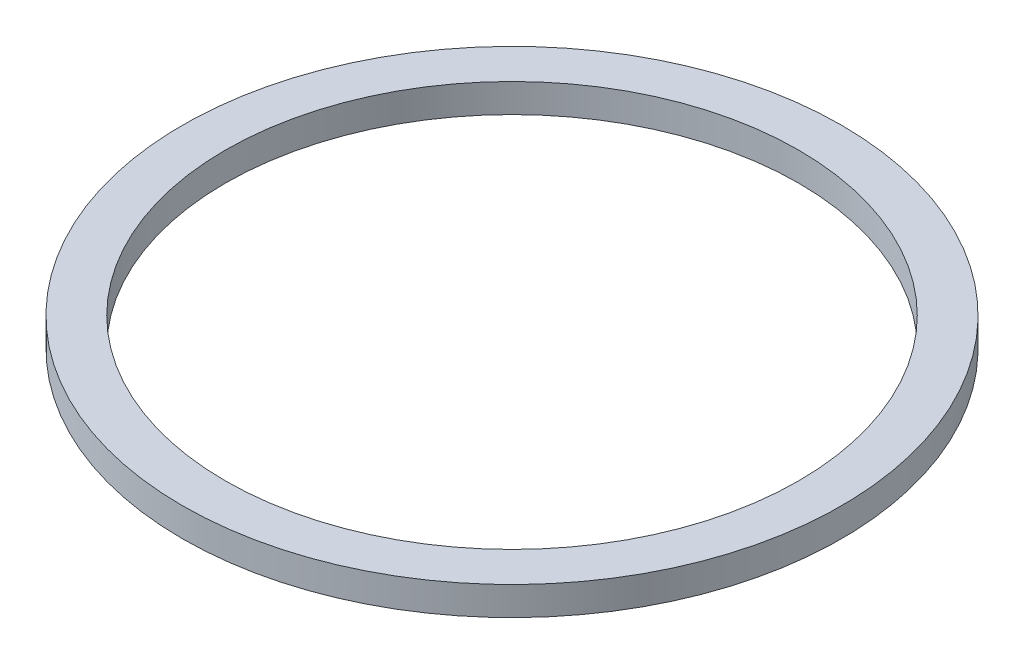
ISO-10303-21;
HEADER;
FILE_DESCRIPTION(('STEP AP214'),'2;1');
FILE_NAME('part.step','',(''),(''),'','','');
FILE_SCHEMA(('AUTOMOTIVE_DESIGN { 1 0 10303 214 1 1 1 1 }'));
ENDSEC;
DATA;
#1=APPLICATION_CONTEXT('core data for automotive mechanical design processes');
#2=APPLICATION_PROTOCOL_DEFINITION('international standard','automotive_design',2000,#1);
#3=PRODUCT_CONTEXT('',#1,'mechanical');
#4=PRODUCT('Part','Part','',(#3));
#5=PRODUCT_RELATED_PRODUCT_CATEGORY('part','',(#4));
#6=PRODUCT_DEFINITION_FORMATION('','',#4);
#7=PRODUCT_DEFINITION_CONTEXT('part definition',#1,'design');
#8=PRODUCT_DEFINITION('design','',#6,#7);
#9=PRODUCT_DEFINITION_SHAPE('','',#8);
#10=(LENGTH_UNIT() NAMED_UNIT(*) SI_UNIT(.MILLI.,.METRE.));
#11=(NAMED_UNIT(*) PLANE_ANGLE_UNIT() SI_UNIT($,.RADIAN.));
#12=(NAMED_UNIT(*) SI_UNIT($,.STERADIAN.) SOLID_ANGLE_UNIT());
#13=UNCERTAINTY_MEASURE_WITH_UNIT(LENGTH_MEASURE(1.E-05),#10,'distance_accuracy_value','');
#14=(GEOMETRIC_REPRESENTATION_CONTEXT(3) GLOBAL_UNCERTAINTY_ASSIGNED_CONTEXT((#13)) GLOBAL_UNIT_ASSIGNED_CONTEXT((#10,
#11,#12)) REPRESENTATION_CONTEXT('',''));
#15=CARTESIAN_POINT('',(0.,0.,0.));
#16=DIRECTION('',(0.,0.,1.));
#17=DIRECTION('',(1.,0.,0.));
#18=AXIS2_PLACEMENT_3D('',#15,#16,#17);
#19=CARTESIAN_POINT('',(0.,5.,0.));
#20=DIRECTION('',(0.,-1.,0.));
#21=DIRECTION('',(0.,0.,-1.));
#22=AXIS2_PLACEMENT_3D('',#19,#20,#21);
#23=CYLINDRICAL_SURFACE('',#22,57.5);
#24=CARTESIAN_POINT('',(0.,5.,0.));
#25=DIRECTION('',(0.,1.,0.));
#26=DIRECTION('',(0.,0.,1.));
#27=AXIS2_PLACEMENT_3D('',#24,#25,#26);
#28=CIRCLE('',#27,57.5);
#29=CARTESIAN_POINT('',(0.,5.,57.5));
#30=VERTEX_POINT('',#29);
#31=EDGE_CURVE('E10',#30,#30,#28,.T.);
#32=ORIENTED_EDGE('',*,*,#31,.F.);
#33=EDGE_LOOP('',(#32));
#34=FACE_BOUND('',#33,.T.);
#35=CARTESIAN_POINT('',(0.,0.,0.));
#36=DIRECTION('',(0.,1.,0.));
#37=DIRECTION('',(0.,0.,1.));
#38=AXIS2_PLACEMENT_3D('',#35,#36,#37);
#39=CIRCLE('',#38,57.5);
#40=CARTESIAN_POINT('',(0.,0.,57.5));
#41=VERTEX_POINT('',#40);
#42=EDGE_CURVE('E37',#41,#41,#39,.T.);
#43=ORIENTED_EDGE('',*,*,#42,.T.);
#44=EDGE_LOOP('',(#43));
#45=FACE_BOUND('',#44,.T.);
#46=ADVANCED_FACE('F40',(#34,#45),#23,.T.);
#47=CARTESIAN_POINT('',(0.,5.,0.));
#48=DIRECTION('',(0.,1.,0.));
#49=DIRECTION('',(0.,0.,1.));
#50=AXIS2_PLACEMENT_3D('',#47,#48,#49);
#51=PLANE('',#50);
#52=CARTESIAN_POINT('',(0.,5.,0.));
#53=DIRECTION('',(0.,1.,0.));
#54=DIRECTION('',(0.,0.,1.));
#55=AXIS2_PLACEMENT_3D('',#52,#53,#54);
#56=CIRCLE('',#55,50.);
#57=CARTESIAN_POINT('',(0.,5.,50.));
#58=VERTEX_POINT('',#57);
#59=EDGE_CURVE('E50',#58,#58,#56,.T.);
#60=ORIENTED_EDGE('',*,*,#59,.F.);
#61=EDGE_LOOP('',(#60));
#62=FACE_BOUND('',#61,.T.);
#63=ORIENTED_EDGE('',*,*,#31,.T.);
#64=EDGE_LOOP('',(#63));
#65=FACE_BOUND('',#64,.T.);
#66=ADVANCED_FACE('F59',(#62,#65),#51,.T.);
#67=CARTESIAN_POINT('',(0.,0.,0.));
#68=DIRECTION('',(0.,1.,0.));
#69=DIRECTION('',(0.,0.,1.));
#70=AXIS2_PLACEMENT_3D('',#67,#68,#69);
#71=PLANE('',#70);
#72=CARTESIAN_POINT('',(0.,0.,0.));
#73=DIRECTION('',(0.,1.,0.));
#74=DIRECTION('',(0.,0.,1.));
#75=AXIS2_PLACEMENT_3D('',#72,#73,#74);
#76=CIRCLE('',#75,50.);
#77=CARTESIAN_POINT('',(0.,0.,50.));
#78=VERTEX_POINT('',#77);
#79=EDGE_CURVE('E47',#78,#78,#76,.T.);
#80=ORIENTED_EDGE('',*,*,#79,.T.);
#81=EDGE_LOOP('',(#80));
#82=FACE_BOUND('',#81,.T.);
#83=ORIENTED_EDGE('',*,*,#42,.F.);
#84=EDGE_LOOP('',(#83));
#85=FACE_BOUND('',#84,.T.);
#86=ADVANCED_FACE('F58',(#82,#85),#71,.F.);
#87=CARTESIAN_POINT('',(0.,5.,0.));
#88=DIRECTION('',(0.,-1.,0.));
#89=DIRECTION('',(0.,0.,-1.));
#90=AXIS2_PLACEMENT_3D('',#87,#88,#89);
#91=CYLINDRICAL_SURFACE('',#90,50.);
#92=ORIENTED_EDGE('',*,*,#59,.T.);
#93=EDGE_LOOP('',(#92));
#94=FACE_BOUND('',#93,.T.);
#95=ORIENTED_EDGE('',*,*,#79,.F.);
#96=EDGE_LOOP('',(#95));
#97=FACE_BOUND('',#96,.T.);
#98=ADVANCED_FACE('F54',(#94,#97),#91,.F.);
#99=CLOSED_SHELL('',(#46,#66,#86,#98));
#100=MANIFOLD_SOLID_BREP('B2',#99);
#101=ADVANCED_BREP_SHAPE_REPRESENTATION('',(#18,#100),#14);
#102=SHAPE_DEFINITION_REPRESENTATION(#9,#101);
ENDSEC;
END-ISO-10303-21;
